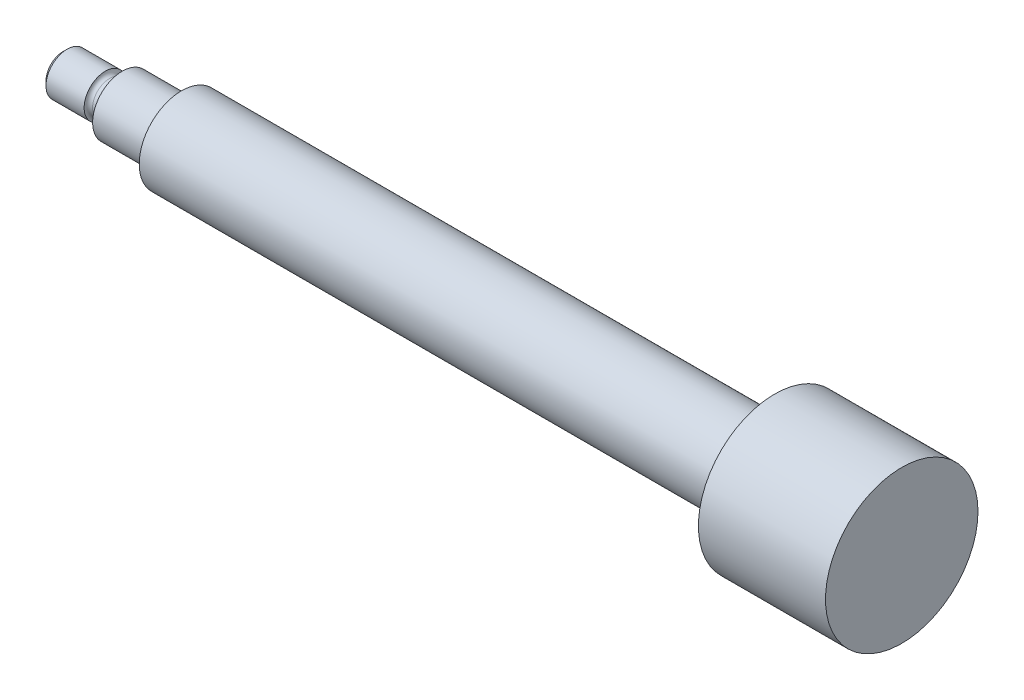
ISO-10303-21;
HEADER;
FILE_DESCRIPTION(('STEP AP214'),'2;1');
FILE_NAME('part.step','',(''),(''),'','','');
FILE_SCHEMA(('AUTOMOTIVE_DESIGN { 1 0 10303 214 1 1 1 1 }'));
ENDSEC;
DATA;
#1=APPLICATION_CONTEXT('core data for automotive mechanical design processes');
#2=APPLICATION_PROTOCOL_DEFINITION('international standard','automotive_design',2000,#1);
#3=PRODUCT_CONTEXT('',#1,'mechanical');
#4=PRODUCT('Part','Part','',(#3));
#5=PRODUCT_RELATED_PRODUCT_CATEGORY('part','',(#4));
#6=PRODUCT_DEFINITION_FORMATION('','',#4);
#7=PRODUCT_DEFINITION_CONTEXT('part definition',#1,'design');
#8=PRODUCT_DEFINITION('design','',#6,#7);
#9=PRODUCT_DEFINITION_SHAPE('','',#8);
#10=(LENGTH_UNIT() NAMED_UNIT(*) SI_UNIT(.MILLI.,.METRE.));
#11=(NAMED_UNIT(*) PLANE_ANGLE_UNIT() SI_UNIT($,.RADIAN.));
#12=(NAMED_UNIT(*) SI_UNIT($,.STERADIAN.) SOLID_ANGLE_UNIT());
#13=UNCERTAINTY_MEASURE_WITH_UNIT(LENGTH_MEASURE(1.E-05),#10,'distance_accuracy_value','');
#14=(GEOMETRIC_REPRESENTATION_CONTEXT(3) GLOBAL_UNCERTAINTY_ASSIGNED_CONTEXT((#13)) GLOBAL_UNIT_ASSIGNED_CONTEXT((#10,
#11,#12)) REPRESENTATION_CONTEXT('',''));
#15=CARTESIAN_POINT('',(0.,0.,0.));
#16=DIRECTION('',(0.,0.,1.));
#17=DIRECTION('',(1.,0.,0.));
#18=AXIS2_PLACEMENT_3D('',#15,#16,#17);
#19=CARTESIAN_POINT('',(70.,0.,0.));
#20=DIRECTION('',(-1.,0.,0.));
#21=DIRECTION('',(0.,0.,1.));
#22=AXIS2_PLACEMENT_3D('',#19,#20,#21);
#23=CYLINDRICAL_SURFACE('',#22,5.);
#24=CARTESIAN_POINT('',(70.,0.,0.));
#25=DIRECTION('',(1.,0.,0.));
#26=DIRECTION('',(0.,0.,-1.));
#27=AXIS2_PLACEMENT_3D('',#24,#25,#26);
#28=CIRCLE('',#27,5.);
#29=CARTESIAN_POINT('',(70.,0.,-5.));
#30=VERTEX_POINT('',#29);
#31=EDGE_CURVE('E86',#30,#30,#28,.T.);
#32=ORIENTED_EDGE('',*,*,#31,.F.);
#33=EDGE_LOOP('',(#32));
#34=FACE_BOUND('',#33,.T.);
#35=CARTESIAN_POINT('',(0.,0.,0.));
#36=DIRECTION('',(1.,0.,0.));
#37=DIRECTION('',(0.,0.,-1.));
#38=AXIS2_PLACEMENT_3D('',#35,#36,#37);
#39=CIRCLE('',#38,5.);
#40=CARTESIAN_POINT('',(0.,0.,-5.));
#41=VERTEX_POINT('',#40);
#42=EDGE_CURVE('E83',#41,#41,#39,.T.);
#43=ORIENTED_EDGE('',*,*,#42,.T.);
#44=EDGE_LOOP('',(#43));
#45=FACE_BOUND('',#44,.T.);
#46=ADVANCED_FACE('F54',(#34,#45),#23,.T.);
#47=CARTESIAN_POINT('',(0.,0.,0.));
#48=DIRECTION('',(1.,0.,0.));
#49=DIRECTION('',(0.,0.,-1.));
#50=AXIS2_PLACEMENT_3D('',#47,#48,#49);
#51=PLANE('',#50);
#52=CARTESIAN_POINT('',(0.,0.,0.));
#53=DIRECTION('',(-1.,0.,0.));
#54=DIRECTION('',(0.,0.,1.));
#55=AXIS2_PLACEMENT_3D('',#52,#53,#54);
#56=CIRCLE('',#55,3.5);
#57=CARTESIAN_POINT('',(0.,0.,3.5));
#58=VERTEX_POINT('',#57);
#59=EDGE_CURVE('E77',#58,#58,#56,.T.);
#60=ORIENTED_EDGE('',*,*,#59,.F.);
#61=EDGE_LOOP('',(#60));
#62=FACE_BOUND('',#61,.T.);
#63=ORIENTED_EDGE('',*,*,#42,.F.);
#64=EDGE_LOOP('',(#63));
#65=FACE_BOUND('',#64,.T.);
#66=ADVANCED_FACE('F116',(#62,#65),#51,.F.);
#67=CARTESIAN_POINT('',(-7.,0.,0.));
#68=DIRECTION('',(1.,0.,0.));
#69=DIRECTION('',(0.,0.,-1.));
#70=AXIS2_PLACEMENT_3D('',#67,#68,#69);
#71=CYLINDRICAL_SURFACE('',#70,3.5);
#72=CARTESIAN_POINT('',(-7.,0.,0.));
#73=DIRECTION('',(-1.,0.,0.));
#74=DIRECTION('',(0.,0.,1.));
#75=AXIS2_PLACEMENT_3D('',#72,#73,#74);
#76=CIRCLE('',#75,3.5);
#77=CARTESIAN_POINT('',(-7.,0.,3.5));
#78=VERTEX_POINT('',#77);
#79=EDGE_CURVE('E81',#78,#78,#76,.T.);
#80=ORIENTED_EDGE('',*,*,#79,.F.);
#81=EDGE_LOOP('',(#80));
#82=FACE_BOUND('',#81,.T.);
#83=ORIENTED_EDGE('',*,*,#59,.T.);
#84=EDGE_LOOP('',(#83));
#85=FACE_BOUND('',#84,.T.);
#86=ADVANCED_FACE('F122',(#82,#85),#71,.T.);
#87=CARTESIAN_POINT('',(-7.,0.,0.));
#88=DIRECTION('',(-1.,0.,0.));
#89=DIRECTION('',(0.,0.,1.));
#90=AXIS2_PLACEMENT_3D('',#87,#88,#89);
#91=PLANE('',#90);
#92=CARTESIAN_POINT('',(-7.,0.,0.));
#93=DIRECTION('',(-1.,0.,0.));
#94=DIRECTION('',(0.,0.,1.));
#95=AXIS2_PLACEMENT_3D('',#92,#93,#94);
#96=CIRCLE('',#95,2.5);
#97=CARTESIAN_POINT('',(-7.,0.,2.5));
#98=VERTEX_POINT('',#97);
#99=EDGE_CURVE('E12',#98,#98,#96,.F.);
#100=ORIENTED_EDGE('',*,*,#99,.T.);
#101=EDGE_LOOP('',(#100));
#102=FACE_BOUND('',#101,.T.);
#103=ORIENTED_EDGE('',*,*,#79,.T.);
#104=EDGE_LOOP('',(#103));
#105=FACE_BOUND('',#104,.T.);
#106=ADVANCED_FACE('F159',(#102,#105),#91,.T.);
#107=CARTESIAN_POINT('',(-9.,0.,0.));
#108=DIRECTION('',(1.,0.,0.));
#109=DIRECTION('',(0.,0.,-1.));
#110=AXIS2_PLACEMENT_3D('',#107,#108,#109);
#111=CYLINDRICAL_SURFACE('',#110,2.);
#112=CARTESIAN_POINT('',(-7.5,0.,0.));
#113=DIRECTION('',(-1.,0.,0.));
#114=DIRECTION('',(0.,0.,1.));
#115=AXIS2_PLACEMENT_3D('',#112,#113,#114);
#116=CIRCLE('',#115,2.);
#117=CARTESIAN_POINT('',(-7.5,0.,2.));
#118=VERTEX_POINT('',#117);
#119=EDGE_CURVE('E61',#118,#118,#116,.T.);
#120=ORIENTED_EDGE('',*,*,#119,.T.);
#121=EDGE_LOOP('',(#120));
#122=FACE_BOUND('',#121,.T.);
#123=CARTESIAN_POINT('',(-8.5,0.,0.));
#124=DIRECTION('',(-1.,0.,0.));
#125=DIRECTION('',(0.,0.,1.));
#126=AXIS2_PLACEMENT_3D('',#123,#124,#125);
#127=CIRCLE('',#126,2.);
#128=CARTESIAN_POINT('',(-8.5,0.,2.));
#129=VERTEX_POINT('',#128);
#130=EDGE_CURVE('E65',#129,#129,#127,.F.);
#131=ORIENTED_EDGE('',*,*,#130,.T.);
#132=EDGE_LOOP('',(#131));
#133=FACE_BOUND('',#132,.T.);
#134=ADVANCED_FACE('F154',(#122,#133),#111,.T.);
#135=CARTESIAN_POINT('',(-14.,0.,0.));
#136=DIRECTION('',(-1.,0.,0.));
#137=DIRECTION('',(0.,0.,1.));
#138=AXIS2_PLACEMENT_3D('',#135,#136,#137);
#139=PLANE('',#138);
#140=CARTESIAN_POINT('',(-14.,0.,0.));
#141=DIRECTION('',(-1.,0.,0.));
#142=DIRECTION('',(0.,0.,1.));
#143=AXIS2_PLACEMENT_3D('',#140,#141,#142);
#144=CIRCLE('',#143,1.99999999999998);
#145=CARTESIAN_POINT('',(-14.,0.,1.99999999999998));
#146=VERTEX_POINT('',#145);
#147=EDGE_CURVE('E74',#146,#146,#144,.T.);
#148=ORIENTED_EDGE('',*,*,#147,.T.);
#149=EDGE_LOOP('',(#148));
#150=FACE_BOUND('',#149,.T.);
#151=ADVANCED_FACE('F148',(#150),#139,.T.);
#152=CARTESIAN_POINT('',(-14.,0.,0.));
#153=DIRECTION('',(1.,0.,0.));
#154=DIRECTION('',(0.,0.,-1.));
#155=AXIS2_PLACEMENT_3D('',#152,#153,#154);
#156=CYLINDRICAL_SURFACE('',#155,2.5);
#157=CARTESIAN_POINT('',(-13.5,0.,0.));
#158=DIRECTION('',(-1.,0.,0.));
#159=DIRECTION('',(0.,0.,1.));
#160=AXIS2_PLACEMENT_3D('',#157,#158,#159);
#161=CIRCLE('',#160,2.5);
#162=CARTESIAN_POINT('',(-13.5,0.,2.5));
#163=VERTEX_POINT('',#162);
#164=EDGE_CURVE('E69',#163,#163,#161,.F.);
#165=ORIENTED_EDGE('',*,*,#164,.T.);
#166=EDGE_LOOP('',(#165));
#167=FACE_BOUND('',#166,.T.);
#168=CARTESIAN_POINT('',(-9.,0.,0.));
#169=DIRECTION('',(-1.,0.,0.));
#170=DIRECTION('',(0.,0.,1.));
#171=AXIS2_PLACEMENT_3D('',#168,#169,#170);
#172=CIRCLE('',#171,2.5);
#173=CARTESIAN_POINT('',(-9.,0.,2.5));
#174=VERTEX_POINT('',#173);
#175=EDGE_CURVE('E78',#174,#174,#172,.T.);
#176=ORIENTED_EDGE('',*,*,#175,.T.);
#177=EDGE_LOOP('',(#176));
#178=FACE_BOUND('',#177,.T.);
#179=ADVANCED_FACE('F132',(#167,#178),#156,.T.);
#180=CARTESIAN_POINT('',(-14.,0.,0.));
#181=DIRECTION('',(1.,0.,0.));
#182=DIRECTION('',(0.,0.,-1.));
#183=AXIS2_PLACEMENT_3D('',#180,#181,#182);
#184=CONICAL_SURFACE('',#183,1.99999999999998,0.785398163397453);
#185=ORIENTED_EDGE('',*,*,#164,.F.);
#186=EDGE_LOOP('',(#185));
#187=FACE_BOUND('',#186,.T.);
#188=ORIENTED_EDGE('',*,*,#147,.F.);
#189=EDGE_LOOP('',(#188));
#190=FACE_BOUND('',#189,.T.);
#191=ADVANCED_FACE('F129',(#187,#190),#184,.T.);
#192=CARTESIAN_POINT('',(-7.5,0.,0.));
#193=DIRECTION('',(-1.,0.,0.));
#194=DIRECTION('',(0.,0.,1.));
#195=AXIS2_PLACEMENT_3D('',#192,#193,#194);
#196=TOROIDAL_SURFACE('',#195,2.5,0.5);
#197=ORIENTED_EDGE('',*,*,#99,.F.);
#198=EDGE_LOOP('',(#197));
#199=FACE_BOUND('',#198,.T.);
#200=ORIENTED_EDGE('',*,*,#119,.F.);
#201=EDGE_LOOP('',(#200));
#202=FACE_BOUND('',#201,.T.);
#203=ADVANCED_FACE('F131',(#199,#202),#196,.F.);
#204=CARTESIAN_POINT('',(-8.5,0.,0.));
#205=DIRECTION('',(-1.,0.,0.));
#206=DIRECTION('',(0.,0.,1.));
#207=AXIS2_PLACEMENT_3D('',#204,#205,#206);
#208=TOROIDAL_SURFACE('',#207,2.5,0.5);
#209=ORIENTED_EDGE('',*,*,#130,.F.);
#210=EDGE_LOOP('',(#209));
#211=FACE_BOUND('',#210,.T.);
#212=ORIENTED_EDGE('',*,*,#175,.F.);
#213=EDGE_LOOP('',(#212));
#214=FACE_BOUND('',#213,.T.);
#215=ADVANCED_FACE('F56',(#211,#214),#208,.F.);
#216=CARTESIAN_POINT('',(85.,0.,0.));
#217=DIRECTION('',(-1.,0.,0.));
#218=DIRECTION('',(0.,0.,1.));
#219=AXIS2_PLACEMENT_3D('',#216,#217,#218);
#220=CYLINDRICAL_SURFACE('',#219,9.);
#221=CARTESIAN_POINT('',(85.,0.,0.));
#222=DIRECTION('',(1.,0.,0.));
#223=DIRECTION('',(0.,0.,-1.));
#224=AXIS2_PLACEMENT_3D('',#221,#222,#223);
#225=CIRCLE('',#224,9.);
#226=CARTESIAN_POINT('',(85.,0.,-9.));
#227=VERTEX_POINT('',#226);
#228=EDGE_CURVE('E82',#227,#227,#225,.T.);
#229=ORIENTED_EDGE('',*,*,#228,.F.);
#230=EDGE_LOOP('',(#229));
#231=FACE_BOUND('',#230,.T.);
#232=CARTESIAN_POINT('',(70.,0.,0.));
#233=DIRECTION('',(1.,0.,0.));
#234=DIRECTION('',(0.,0.,-1.));
#235=AXIS2_PLACEMENT_3D('',#232,#233,#234);
#236=CIRCLE('',#235,9.);
#237=CARTESIAN_POINT('',(70.,0.,-9.));
#238=VERTEX_POINT('',#237);
#239=EDGE_CURVE('E93',#238,#238,#236,.T.);
#240=ORIENTED_EDGE('',*,*,#239,.T.);
#241=EDGE_LOOP('',(#240));
#242=FACE_BOUND('',#241,.T.);
#243=ADVANCED_FACE('F101',(#231,#242),#220,.T.);
#244=CARTESIAN_POINT('',(85.,0.,0.));
#245=DIRECTION('',(1.,0.,0.));
#246=DIRECTION('',(0.,0.,-1.));
#247=AXIS2_PLACEMENT_3D('',#244,#245,#246);
#248=PLANE('',#247);
#249=ORIENTED_EDGE('',*,*,#228,.T.);
#250=EDGE_LOOP('',(#249));
#251=FACE_BOUND('',#250,.T.);
#252=ADVANCED_FACE('F99',(#251),#248,.T.);
#253=CARTESIAN_POINT('',(70.,0.,0.));
#254=DIRECTION('',(1.,0.,0.));
#255=DIRECTION('',(0.,0.,-1.));
#256=AXIS2_PLACEMENT_3D('',#253,#254,#255);
#257=PLANE('',#256);
#258=ORIENTED_EDGE('',*,*,#31,.T.);
#259=EDGE_LOOP('',(#258));
#260=FACE_BOUND('',#259,.T.);
#261=ORIENTED_EDGE('',*,*,#239,.F.);
#262=EDGE_LOOP('',(#261));
#263=FACE_BOUND('',#262,.T.);
#264=ADVANCED_FACE('F107',(#260,#263),#257,.F.);
#265=CLOSED_SHELL('',(#46,#66,#86,#106,#134,#151,#179,#191,#203,#215,#243,#252,#264));
#266=MANIFOLD_SOLID_BREP('B2',#265);
#267=ADVANCED_BREP_SHAPE_REPRESENTATION('',(#18,#266),#14);
#268=SHAPE_DEFINITION_REPRESENTATION(#9,#267);
ENDSEC;
END-ISO-10303-21;
